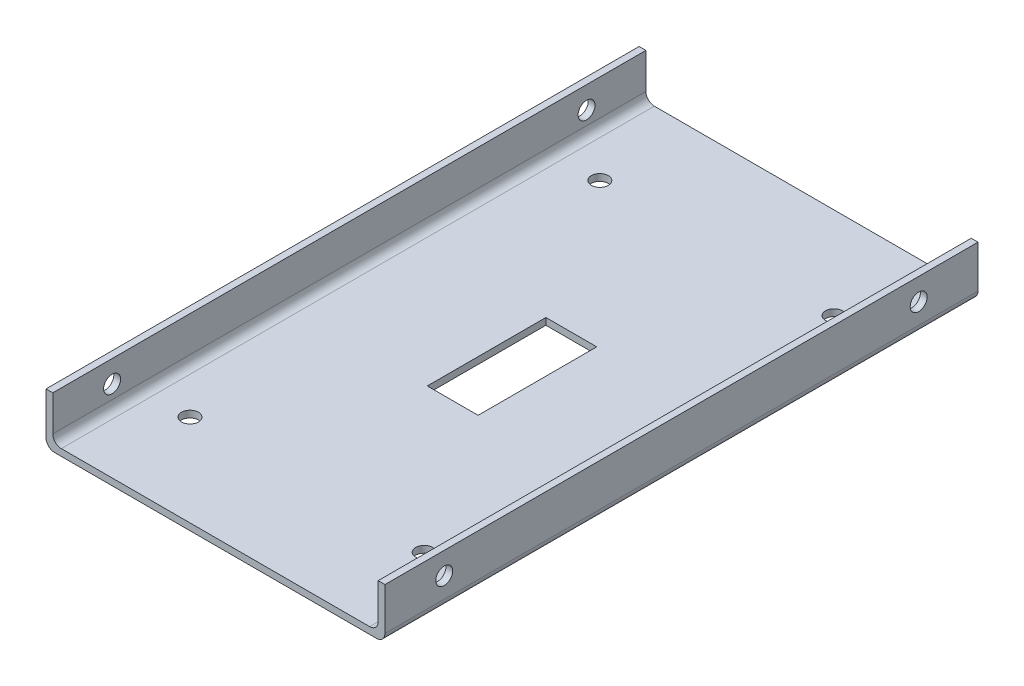
ISO-10303-21;
HEADER;
FILE_DESCRIPTION(('STEP AP214'),'2;1');
FILE_NAME('part.step','',(''),(''),'','','');
FILE_SCHEMA(('AUTOMOTIVE_DESIGN { 1 0 10303 214 1 1 1 1 }'));
ENDSEC;
DATA;
#1=APPLICATION_CONTEXT('core data for automotive mechanical design processes');
#2=APPLICATION_PROTOCOL_DEFINITION('international standard','automotive_design',2000,#1);
#3=PRODUCT_CONTEXT('',#1,'mechanical');
#4=PRODUCT('Part','Part','',(#3));
#5=PRODUCT_RELATED_PRODUCT_CATEGORY('part','',(#4));
#6=PRODUCT_DEFINITION_FORMATION('','',#4);
#7=PRODUCT_DEFINITION_CONTEXT('part definition',#1,'design');
#8=PRODUCT_DEFINITION('design','',#6,#7);
#9=PRODUCT_DEFINITION_SHAPE('','',#8);
#10=(LENGTH_UNIT() NAMED_UNIT(*) SI_UNIT(.MILLI.,.METRE.));
#11=(NAMED_UNIT(*) PLANE_ANGLE_UNIT() SI_UNIT($,.RADIAN.));
#12=(NAMED_UNIT(*) SI_UNIT($,.STERADIAN.) SOLID_ANGLE_UNIT());
#13=UNCERTAINTY_MEASURE_WITH_UNIT(LENGTH_MEASURE(1.E-05),#10,'distance_accuracy_value','');
#14=(GEOMETRIC_REPRESENTATION_CONTEXT(3) GLOBAL_UNCERTAINTY_ASSIGNED_CONTEXT((#13)) GLOBAL_UNIT_ASSIGNED_CONTEXT((#10,
#11,#12)) REPRESENTATION_CONTEXT('',''));
#15=CARTESIAN_POINT('',(0.,0.,0.));
#16=DIRECTION('',(0.,0.,1.));
#17=DIRECTION('',(1.,0.,0.));
#18=AXIS2_PLACEMENT_3D('',#15,#16,#17);
#19=CARTESIAN_POINT('',(0.,0.,350.));
#20=DIRECTION('',(0.,1.,0.));
#21=DIRECTION('',(0.,0.,1.));
#22=AXIS2_PLACEMENT_3D('',#19,#20,#21);
#23=PLANE('',#22);
#24=DIRECTION('',(1.,0.,0.));
#25=VECTOR('',#24,1.);
#26=CARTESIAN_POINT('',(0.,0.,350.));
#27=LINE('',#26,#25);
#28=CARTESIAN_POINT('',(5.,0.,350.));
#29=VERTEX_POINT('',#28);
#30=CARTESIAN_POINT('',(195.,0.,350.));
#31=VERTEX_POINT('',#30);
#32=EDGE_CURVE('E210',#29,#31,#27,.T.);
#33=ORIENTED_EDGE('',*,*,#32,.F.);
#34=DIRECTION('',(0.,0.,-1.));
#35=VECTOR('',#34,1.);
#36=CARTESIAN_POINT('',(5.,0.,350.));
#37=LINE('',#36,#35);
#38=CARTESIAN_POINT('',(5.,0.,0.));
#39=VERTEX_POINT('',#38);
#40=EDGE_CURVE('E260',#29,#39,#37,.T.);
#41=ORIENTED_EDGE('',*,*,#40,.T.);
#42=DIRECTION('',(1.,0.,0.));
#43=VECTOR('',#42,1.);
#44=CARTESIAN_POINT('',(0.,0.,0.));
#45=LINE('',#44,#43);
#46=CARTESIAN_POINT('',(195.,0.,0.));
#47=VERTEX_POINT('',#46);
#48=EDGE_CURVE('E231',#39,#47,#45,.T.);
#49=ORIENTED_EDGE('',*,*,#48,.T.);
#50=DIRECTION('',(0.,0.,-1.));
#51=VECTOR('',#50,1.);
#52=CARTESIAN_POINT('',(195.,0.,350.));
#53=LINE('',#52,#51);
#54=EDGE_CURVE('E258',#47,#31,#53,.F.);
#55=ORIENTED_EDGE('',*,*,#54,.T.);
#56=EDGE_LOOP('',(#33,#41,#49,#55));
#57=FACE_BOUND('',#56,.T.);
#58=CARTESIAN_POINT('',(30.8949335860125,0.,54.0661337755218));
#59=DIRECTION('',(0.,1.,0.));
#60=DIRECTION('',(0.,0.,1.));
#61=AXIS2_PLACEMENT_3D('',#58,#59,#60);
#62=CIRCLE('',#61,5.);
#63=CARTESIAN_POINT('',(30.8949335860125,0.,59.0661337755218));
#64=VERTEX_POINT('',#63);
#65=EDGE_CURVE('E182',#64,#64,#62,.T.);
#66=ORIENTED_EDGE('',*,*,#65,.T.);
#67=EDGE_LOOP('',(#66));
#68=FACE_BOUND('',#67,.T.);
#69=CARTESIAN_POINT('',(169.105066413988,0.,54.0661337755218));
#70=DIRECTION('',(0.,1.,0.));
#71=DIRECTION('',(0.,0.,1.));
#72=AXIS2_PLACEMENT_3D('',#69,#70,#71);
#73=CIRCLE('',#72,4.99999999999999);
#74=CARTESIAN_POINT('',(169.105066413988,0.,59.0661337755218));
#75=VERTEX_POINT('',#74);
#76=EDGE_CURVE('E178',#75,#75,#73,.T.);
#77=ORIENTED_EDGE('',*,*,#76,.T.);
#78=EDGE_LOOP('',(#77));
#79=FACE_BOUND('',#78,.T.);
#80=CARTESIAN_POINT('',(169.105066413988,0.,295.933866224478));
#81=DIRECTION('',(0.,1.,0.));
#82=DIRECTION('',(0.,0.,1.));
#83=AXIS2_PLACEMENT_3D('',#80,#81,#82);
#84=CIRCLE('',#83,4.99999999999999);
#85=CARTESIAN_POINT('',(169.105066413988,0.,300.933866224478));
#86=VERTEX_POINT('',#85);
#87=EDGE_CURVE('E174',#86,#86,#84,.T.);
#88=ORIENTED_EDGE('',*,*,#87,.T.);
#89=EDGE_LOOP('',(#88));
#90=FACE_BOUND('',#89,.T.);
#91=CARTESIAN_POINT('',(30.8949335860124,0.,295.933866224478));
#92=DIRECTION('',(0.,1.,0.));
#93=DIRECTION('',(0.,0.,1.));
#94=AXIS2_PLACEMENT_3D('',#91,#92,#93);
#95=CIRCLE('',#94,5.);
#96=CARTESIAN_POINT('',(30.8949335860124,0.,300.933866224478));
#97=VERTEX_POINT('',#96);
#98=EDGE_CURVE('E149',#97,#97,#95,.T.);
#99=ORIENTED_EDGE('',*,*,#98,.T.);
#100=EDGE_LOOP('',(#99));
#101=FACE_BOUND('',#100,.T.);
#102=DIRECTION('',(0.,0.,1.));
#103=VECTOR('',#102,1.);
#104=CARTESIAN_POINT('',(85.0000000000001,0.,140.));
#105=LINE('',#104,#103);
#106=CARTESIAN_POINT('',(85.0000000000001,0.,140.));
#107=VERTEX_POINT('',#106);
#108=CARTESIAN_POINT('',(85.0000000000001,0.,210.));
#109=VERTEX_POINT('',#108);
#110=EDGE_CURVE('E47',#107,#109,#105,.T.);
#111=ORIENTED_EDGE('',*,*,#110,.T.);
#112=DIRECTION('',(1.,0.,0.));
#113=VECTOR('',#112,1.);
#114=CARTESIAN_POINT('',(115.,0.,210.));
#115=LINE('',#114,#113);
#116=CARTESIAN_POINT('',(115.,0.,210.));
#117=VERTEX_POINT('',#116);
#118=EDGE_CURVE('E153',#109,#117,#115,.T.);
#119=ORIENTED_EDGE('',*,*,#118,.T.);
#120=DIRECTION('',(0.,0.,-1.));
#121=VECTOR('',#120,1.);
#122=CARTESIAN_POINT('',(115.,0.,140.));
#123=LINE('',#122,#121);
#124=CARTESIAN_POINT('',(115.,0.,140.));
#125=VERTEX_POINT('',#124);
#126=EDGE_CURVE('E159',#117,#125,#123,.T.);
#127=ORIENTED_EDGE('',*,*,#126,.T.);
#128=DIRECTION('',(-1.,0.,0.));
#129=VECTOR('',#128,1.);
#130=CARTESIAN_POINT('',(115.,0.,140.));
#131=LINE('',#130,#129);
#132=EDGE_CURVE('E162',#125,#107,#131,.T.);
#133=ORIENTED_EDGE('',*,*,#132,.T.);
#134=EDGE_LOOP('',(#111,#119,#127,#133));
#135=FACE_BOUND('',#134,.T.);
#136=ADVANCED_FACE('F32',(#57,#68,#79,#90,#101,#135),#23,.F.);
#137=CARTESIAN_POINT('',(4.00000000000001,4.,350.));
#138=DIRECTION('',(0.,-1.,0.));
#139=DIRECTION('',(1.,0.,0.));
#140=AXIS2_PLACEMENT_3D('',#137,#138,#139);
#141=PLANE('',#140);
#142=DIRECTION('',(-1.,0.,0.));
#143=VECTOR('',#142,1.);
#144=CARTESIAN_POINT('',(4.00000000000001,4.,350.));
#145=LINE('',#144,#143);
#146=CARTESIAN_POINT('',(191.,4.,350.));
#147=VERTEX_POINT('',#146);
#148=CARTESIAN_POINT('',(9.00000000000001,4.,350.));
#149=VERTEX_POINT('',#148);
#150=EDGE_CURVE('E221',#147,#149,#145,.T.);
#151=ORIENTED_EDGE('',*,*,#150,.F.);
#152=DIRECTION('',(0.,0.,-1.));
#153=VECTOR('',#152,1.);
#154=CARTESIAN_POINT('',(191.,4.,0.));
#155=LINE('',#154,#153);
#156=CARTESIAN_POINT('',(191.,4.,0.));
#157=VERTEX_POINT('',#156);
#158=EDGE_CURVE('E278',#147,#157,#155,.T.);
#159=ORIENTED_EDGE('',*,*,#158,.T.);
#160=DIRECTION('',(-1.,0.,0.));
#161=VECTOR('',#160,1.);
#162=CARTESIAN_POINT('',(4.00000000000001,4.,0.));
#163=LINE('',#162,#161);
#164=CARTESIAN_POINT('',(9.00000000000001,4.,0.));
#165=VERTEX_POINT('',#164);
#166=EDGE_CURVE('E241',#157,#165,#163,.T.);
#167=ORIENTED_EDGE('',*,*,#166,.T.);
#168=DIRECTION('',(0.,0.,-1.));
#169=VECTOR('',#168,1.);
#170=CARTESIAN_POINT('',(9.00000000000001,4.,350.));
#171=LINE('',#170,#169);
#172=EDGE_CURVE('E276',#165,#149,#171,.F.);
#173=ORIENTED_EDGE('',*,*,#172,.T.);
#174=EDGE_LOOP('',(#151,#159,#167,#173));
#175=FACE_BOUND('',#174,.T.);
#176=CARTESIAN_POINT('',(30.8949335860125,4.,54.0661337755218));
#177=DIRECTION('',(0.,-1.,0.));
#178=DIRECTION('',(1.,0.,0.));
#179=AXIS2_PLACEMENT_3D('',#176,#177,#178);
#180=CIRCLE('',#179,5.);
#181=CARTESIAN_POINT('',(35.8949335860124,4.,54.0661337755218));
#182=VERTEX_POINT('',#181);
#183=EDGE_CURVE('E185',#182,#182,#180,.F.);
#184=ORIENTED_EDGE('',*,*,#183,.F.);
#185=EDGE_LOOP('',(#184));
#186=FACE_BOUND('',#185,.T.);
#187=CARTESIAN_POINT('',(169.105066413988,4.,54.0661337755218));
#188=DIRECTION('',(0.,-1.,0.));
#189=DIRECTION('',(1.,0.,0.));
#190=AXIS2_PLACEMENT_3D('',#187,#188,#189);
#191=CIRCLE('',#190,4.99999999999999);
#192=CARTESIAN_POINT('',(174.105066413988,4.,54.0661337755218));
#193=VERTEX_POINT('',#192);
#194=EDGE_CURVE('E181',#193,#193,#191,.F.);
#195=ORIENTED_EDGE('',*,*,#194,.F.);
#196=EDGE_LOOP('',(#195));
#197=FACE_BOUND('',#196,.T.);
#198=CARTESIAN_POINT('',(169.105066413988,4.,295.933866224478));
#199=DIRECTION('',(0.,-1.,0.));
#200=DIRECTION('',(1.,0.,0.));
#201=AXIS2_PLACEMENT_3D('',#198,#199,#200);
#202=CIRCLE('',#201,4.99999999999999);
#203=CARTESIAN_POINT('',(174.105066413988,4.,295.933866224478));
#204=VERTEX_POINT('',#203);
#205=EDGE_CURVE('E177',#204,#204,#202,.F.);
#206=ORIENTED_EDGE('',*,*,#205,.F.);
#207=EDGE_LOOP('',(#206));
#208=FACE_BOUND('',#207,.T.);
#209=CARTESIAN_POINT('',(30.8949335860124,4.,295.933866224478));
#210=DIRECTION('',(0.,-1.,0.));
#211=DIRECTION('',(1.,0.,0.));
#212=AXIS2_PLACEMENT_3D('',#209,#210,#211);
#213=CIRCLE('',#212,5.);
#214=CARTESIAN_POINT('',(35.8949335860124,4.,295.933866224478));
#215=VERTEX_POINT('',#214);
#216=EDGE_CURVE('E173',#215,#215,#213,.F.);
#217=ORIENTED_EDGE('',*,*,#216,.F.);
#218=EDGE_LOOP('',(#217));
#219=FACE_BOUND('',#218,.T.);
#220=DIRECTION('',(0.,0.,1.));
#221=VECTOR('',#220,1.);
#222=CARTESIAN_POINT('',(85.0000000000001,4.,350.));
#223=LINE('',#222,#221);
#224=CARTESIAN_POINT('',(85.0000000000001,4.,140.));
#225=VERTEX_POINT('',#224);
#226=CARTESIAN_POINT('',(85.0000000000001,4.,210.));
#227=VERTEX_POINT('',#226);
#228=EDGE_CURVE('E11',#225,#227,#223,.T.);
#229=ORIENTED_EDGE('',*,*,#228,.F.);
#230=DIRECTION('',(-1.,0.,0.));
#231=VECTOR('',#230,1.);
#232=CARTESIAN_POINT('',(3.99999999999982,4.,140.));
#233=LINE('',#232,#231);
#234=CARTESIAN_POINT('',(115.,4.,140.));
#235=VERTEX_POINT('',#234);
#236=EDGE_CURVE('E294',#235,#225,#233,.T.);
#237=ORIENTED_EDGE('',*,*,#236,.F.);
#238=DIRECTION('',(0.,0.,-1.));
#239=VECTOR('',#238,1.);
#240=CARTESIAN_POINT('',(115.,4.,350.));
#241=LINE('',#240,#239);
#242=CARTESIAN_POINT('',(115.,4.,210.));
#243=VERTEX_POINT('',#242);
#244=EDGE_CURVE('E308',#243,#235,#241,.T.);
#245=ORIENTED_EDGE('',*,*,#244,.F.);
#246=DIRECTION('',(1.,0.,0.));
#247=VECTOR('',#246,1.);
#248=CARTESIAN_POINT('',(3.99999999999988,4.,210.));
#249=LINE('',#248,#247);
#250=EDGE_CURVE('E40',#227,#243,#249,.T.);
#251=ORIENTED_EDGE('',*,*,#250,.F.);
#252=EDGE_LOOP('',(#229,#237,#245,#251));
#253=FACE_BOUND('',#252,.T.);
#254=ADVANCED_FACE('F314',(#175,#186,#197,#208,#219,#253),#141,.F.);
#255=CARTESIAN_POINT('',(0.,30.,350.));
#256=DIRECTION('',(1.,0.,0.));
#257=DIRECTION('',(0.,1.,0.));
#258=AXIS2_PLACEMENT_3D('',#255,#256,#257);
#259=PLANE('',#258);
#260=CARTESIAN_POINT('',(0.,17.0000000000004,34.9999999999999));
#261=DIRECTION('',(1.,0.,0.));
#262=DIRECTION('',(0.,1.,0.));
#263=AXIS2_PLACEMENT_3D('',#260,#261,#262);
#264=CIRCLE('',#263,5.);
#265=CARTESIAN_POINT('',(0.,22.0000000000004,34.9999999999999));
#266=VERTEX_POINT('',#265);
#267=EDGE_CURVE('E193',#266,#266,#264,.T.);
#268=ORIENTED_EDGE('',*,*,#267,.T.);
#269=EDGE_LOOP('',(#268));
#270=FACE_BOUND('',#269,.T.);
#271=CARTESIAN_POINT('',(0.,17.0000000000004,315.));
#272=DIRECTION('',(1.,0.,0.));
#273=DIRECTION('',(0.,1.,0.));
#274=AXIS2_PLACEMENT_3D('',#271,#272,#273);
#275=CIRCLE('',#274,4.99999999999999);
#276=CARTESIAN_POINT('',(0.,22.0000000000004,315.));
#277=VERTEX_POINT('',#276);
#278=EDGE_CURVE('E203',#277,#277,#275,.T.);
#279=ORIENTED_EDGE('',*,*,#278,.T.);
#280=EDGE_LOOP('',(#279));
#281=FACE_BOUND('',#280,.T.);
#282=DIRECTION('',(0.,-1.,0.));
#283=VECTOR('',#282,1.);
#284=CARTESIAN_POINT('',(0.,30.,0.));
#285=LINE('',#284,#283);
#286=CARTESIAN_POINT('',(0.,30.,0.));
#287=VERTEX_POINT('',#286);
#288=CARTESIAN_POINT('',(0.,5.,0.));
#289=VERTEX_POINT('',#288);
#290=EDGE_CURVE('E206',#287,#289,#285,.T.);
#291=ORIENTED_EDGE('',*,*,#290,.T.);
#292=DIRECTION('',(0.,0.,-1.));
#293=VECTOR('',#292,1.);
#294=CARTESIAN_POINT('',(0.,5.,350.));
#295=LINE('',#294,#293);
#296=CARTESIAN_POINT('',(0.,5.,350.));
#297=VERTEX_POINT('',#296);
#298=EDGE_CURVE('E267',#289,#297,#295,.F.);
#299=ORIENTED_EDGE('',*,*,#298,.T.);
#300=DIRECTION('',(0.,-1.,0.));
#301=VECTOR('',#300,1.);
#302=CARTESIAN_POINT('',(0.,30.,350.));
#303=LINE('',#302,#301);
#304=CARTESIAN_POINT('',(0.,30.,350.));
#305=VERTEX_POINT('',#304);
#306=EDGE_CURVE('E207',#305,#297,#303,.T.);
#307=ORIENTED_EDGE('',*,*,#306,.F.);
#308=DIRECTION('',(0.,0.,-1.));
#309=VECTOR('',#308,1.);
#310=CARTESIAN_POINT('',(0.,30.,350.));
#311=LINE('',#310,#309);
#312=EDGE_CURVE('E228',#305,#287,#311,.T.);
#313=ORIENTED_EDGE('',*,*,#312,.T.);
#314=EDGE_LOOP('',(#291,#299,#307,#313));
#315=FACE_BOUND('',#314,.T.);
#316=ADVANCED_FACE('F328',(#270,#281,#315),#259,.F.);
#317=CARTESIAN_POINT('',(200.,30.,350.));
#318=DIRECTION('',(-1.,0.,0.));
#319=DIRECTION('',(0.,-1.,0.));
#320=AXIS2_PLACEMENT_3D('',#317,#318,#319);
#321=PLANE('',#320);
#322=CARTESIAN_POINT('',(200.,17.0000000000001,34.9999999999999));
#323=DIRECTION('',(1.,0.,0.));
#324=DIRECTION('',(0.,1.,0.));
#325=AXIS2_PLACEMENT_3D('',#322,#323,#324);
#326=CIRCLE('',#325,5.);
#327=CARTESIAN_POINT('',(200.,22.0000000000001,34.9999999999999));
#328=VERTEX_POINT('',#327);
#329=EDGE_CURVE('E186',#328,#328,#326,.T.);
#330=ORIENTED_EDGE('',*,*,#329,.F.);
#331=EDGE_LOOP('',(#330));
#332=FACE_BOUND('',#331,.T.);
#333=CARTESIAN_POINT('',(200.,17.0000000000001,315.));
#334=DIRECTION('',(1.,0.,0.));
#335=DIRECTION('',(0.,1.,0.));
#336=AXIS2_PLACEMENT_3D('',#333,#334,#335);
#337=CIRCLE('',#336,4.99999999999999);
#338=CARTESIAN_POINT('',(200.,22.0000000000001,315.));
#339=VERTEX_POINT('',#338);
#340=EDGE_CURVE('E196',#339,#339,#337,.T.);
#341=ORIENTED_EDGE('',*,*,#340,.F.);
#342=EDGE_LOOP('',(#341));
#343=FACE_BOUND('',#342,.T.);
#344=DIRECTION('',(0.,1.,0.));
#345=VECTOR('',#344,1.);
#346=CARTESIAN_POINT('',(200.,30.,350.));
#347=LINE('',#346,#345);
#348=CARTESIAN_POINT('',(200.,5.,350.));
#349=VERTEX_POINT('',#348);
#350=CARTESIAN_POINT('',(200.,30.,350.));
#351=VERTEX_POINT('',#350);
#352=EDGE_CURVE('E214',#349,#351,#347,.T.);
#353=ORIENTED_EDGE('',*,*,#352,.F.);
#354=DIRECTION('',(0.,0.,-1.));
#355=VECTOR('',#354,1.);
#356=CARTESIAN_POINT('',(200.,5.,350.));
#357=LINE('',#356,#355);
#358=CARTESIAN_POINT('',(200.,5.,0.));
#359=VERTEX_POINT('',#358);
#360=EDGE_CURVE('E273',#349,#359,#357,.T.);
#361=ORIENTED_EDGE('',*,*,#360,.T.);
#362=DIRECTION('',(0.,1.,0.));
#363=VECTOR('',#362,1.);
#364=CARTESIAN_POINT('',(200.,30.,0.));
#365=LINE('',#364,#363);
#366=CARTESIAN_POINT('',(200.,30.,0.));
#367=VERTEX_POINT('',#366);
#368=EDGE_CURVE('E234',#359,#367,#365,.T.);
#369=ORIENTED_EDGE('',*,*,#368,.T.);
#370=DIRECTION('',(0.,0.,-1.));
#371=VECTOR('',#370,1.);
#372=CARTESIAN_POINT('',(200.,30.,350.));
#373=LINE('',#372,#371);
#374=EDGE_CURVE('E255',#351,#367,#373,.T.);
#375=ORIENTED_EDGE('',*,*,#374,.F.);
#376=EDGE_LOOP('',(#353,#361,#369,#375));
#377=FACE_BOUND('',#376,.T.);
#378=ADVANCED_FACE('F335',(#332,#343,#377),#321,.F.);
#379=CARTESIAN_POINT('',(196.,30.,350.));
#380=DIRECTION('',(0.,-1.,0.));
#381=DIRECTION('',(0.,0.,-1.));
#382=AXIS2_PLACEMENT_3D('',#379,#380,#381);
#383=PLANE('',#382);
#384=DIRECTION('',(-1.,0.,0.));
#385=VECTOR('',#384,1.);
#386=CARTESIAN_POINT('',(196.,30.,0.));
#387=LINE('',#386,#385);
#388=CARTESIAN_POINT('',(196.,30.,0.));
#389=VERTEX_POINT('',#388);
#390=EDGE_CURVE('E236',#367,#389,#387,.T.);
#391=ORIENTED_EDGE('',*,*,#390,.T.);
#392=DIRECTION('',(0.,0.,-1.));
#393=VECTOR('',#392,1.);
#394=CARTESIAN_POINT('',(196.,30.,350.));
#395=LINE('',#394,#393);
#396=CARTESIAN_POINT('',(196.,30.,350.));
#397=VERTEX_POINT('',#396);
#398=EDGE_CURVE('E252',#397,#389,#395,.T.);
#399=ORIENTED_EDGE('',*,*,#398,.F.);
#400=DIRECTION('',(-1.,0.,0.));
#401=VECTOR('',#400,1.);
#402=CARTESIAN_POINT('',(196.,30.,350.));
#403=LINE('',#402,#401);
#404=EDGE_CURVE('E216',#351,#397,#403,.T.);
#405=ORIENTED_EDGE('',*,*,#404,.F.);
#406=ORIENTED_EDGE('',*,*,#374,.T.);
#407=EDGE_LOOP('',(#391,#399,#405,#406));
#408=FACE_BOUND('',#407,.T.);
#409=ADVANCED_FACE('F397',(#408),#383,.F.);
#410=CARTESIAN_POINT('',(196.,4.,350.));
#411=DIRECTION('',(1.,0.,0.));
#412=DIRECTION('',(0.,0.,-1.));
#413=AXIS2_PLACEMENT_3D('',#410,#411,#412);
#414=PLANE('',#413);
#415=CARTESIAN_POINT('',(196.,17.0000000000001,34.9999999999999));
#416=DIRECTION('',(1.,0.,0.));
#417=DIRECTION('',(0.,0.,-1.));
#418=AXIS2_PLACEMENT_3D('',#415,#416,#417);
#419=CIRCLE('',#418,5.);
#420=CARTESIAN_POINT('',(196.,17.0000000000001,29.9999999999999));
#421=VERTEX_POINT('',#420);
#422=EDGE_CURVE('E190',#421,#421,#419,.T.);
#423=ORIENTED_EDGE('',*,*,#422,.T.);
#424=EDGE_LOOP('',(#423));
#425=FACE_BOUND('',#424,.T.);
#426=CARTESIAN_POINT('',(196.,17.0000000000001,315.));
#427=DIRECTION('',(1.,0.,0.));
#428=DIRECTION('',(0.,0.,-1.));
#429=AXIS2_PLACEMENT_3D('',#426,#427,#428);
#430=CIRCLE('',#429,4.99999999999999);
#431=CARTESIAN_POINT('',(196.,17.0000000000001,310.));
#432=VERTEX_POINT('',#431);
#433=EDGE_CURVE('E200',#432,#432,#430,.T.);
#434=ORIENTED_EDGE('',*,*,#433,.T.);
#435=EDGE_LOOP('',(#434));
#436=FACE_BOUND('',#435,.T.);
#437=DIRECTION('',(0.,-1.,0.));
#438=VECTOR('',#437,1.);
#439=CARTESIAN_POINT('',(196.,4.,0.));
#440=LINE('',#439,#438);
#441=CARTESIAN_POINT('',(196.,9.,0.));
#442=VERTEX_POINT('',#441);
#443=EDGE_CURVE('E238',#389,#442,#440,.T.);
#444=ORIENTED_EDGE('',*,*,#443,.T.);
#445=DIRECTION('',(0.,0.,-1.));
#446=VECTOR('',#445,1.);
#447=CARTESIAN_POINT('',(196.,9.,350.));
#448=LINE('',#447,#446);
#449=CARTESIAN_POINT('',(196.,9.,350.));
#450=VERTEX_POINT('',#449);
#451=EDGE_CURVE('E281',#442,#450,#448,.F.);
#452=ORIENTED_EDGE('',*,*,#451,.T.);
#453=DIRECTION('',(0.,-1.,0.));
#454=VECTOR('',#453,1.);
#455=CARTESIAN_POINT('',(196.,4.,350.));
#456=LINE('',#455,#454);
#457=EDGE_CURVE('E218',#397,#450,#456,.T.);
#458=ORIENTED_EDGE('',*,*,#457,.F.);
#459=ORIENTED_EDGE('',*,*,#398,.T.);
#460=EDGE_LOOP('',(#444,#452,#458,#459));
#461=FACE_BOUND('',#460,.T.);
#462=ADVANCED_FACE('F400',(#425,#436,#461),#414,.F.);
#463=CARTESIAN_POINT('',(4.,30.,350.));
#464=DIRECTION('',(-1.,0.,0.));
#465=DIRECTION('',(0.,-1.,0.));
#466=AXIS2_PLACEMENT_3D('',#463,#464,#465);
#467=PLANE('',#466);
#468=CARTESIAN_POINT('',(4.,17.0000000000004,34.9999999999999));
#469=DIRECTION('',(-1.,0.,0.));
#470=DIRECTION('',(0.,-1.,0.));
#471=AXIS2_PLACEMENT_3D('',#468,#469,#470);
#472=CIRCLE('',#471,5.);
#473=CARTESIAN_POINT('',(4.00000000000001,12.0000000000004,34.9999999999999));
#474=VERTEX_POINT('',#473);
#475=EDGE_CURVE('E189',#474,#474,#472,.T.);
#476=ORIENTED_EDGE('',*,*,#475,.T.);
#477=EDGE_LOOP('',(#476));
#478=FACE_BOUND('',#477,.T.);
#479=CARTESIAN_POINT('',(4.,17.0000000000004,315.));
#480=DIRECTION('',(-1.,0.,0.));
#481=DIRECTION('',(0.,-1.,0.));
#482=AXIS2_PLACEMENT_3D('',#479,#480,#481);
#483=CIRCLE('',#482,4.99999999999999);
#484=CARTESIAN_POINT('',(4.00000000000001,12.0000000000004,315.));
#485=VERTEX_POINT('',#484);
#486=EDGE_CURVE('E199',#485,#485,#483,.T.);
#487=ORIENTED_EDGE('',*,*,#486,.T.);
#488=EDGE_LOOP('',(#487));
#489=FACE_BOUND('',#488,.T.);
#490=DIRECTION('',(0.,1.,0.));
#491=VECTOR('',#490,1.);
#492=CARTESIAN_POINT('',(4.,30.,350.));
#493=LINE('',#492,#491);
#494=CARTESIAN_POINT('',(4.00000000000001,9.00000000000001,350.));
#495=VERTEX_POINT('',#494);
#496=CARTESIAN_POINT('',(4.,30.,350.));
#497=VERTEX_POINT('',#496);
#498=EDGE_CURVE('E224',#495,#497,#493,.T.);
#499=ORIENTED_EDGE('',*,*,#498,.F.);
#500=DIRECTION('',(0.,0.,-1.));
#501=VECTOR('',#500,1.);
#502=CARTESIAN_POINT('',(4.00000000000001,9.,0.));
#503=LINE('',#502,#501);
#504=CARTESIAN_POINT('',(4.00000000000001,9.00000000000001,0.));
#505=VERTEX_POINT('',#504);
#506=EDGE_CURVE('E283',#495,#505,#503,.T.);
#507=ORIENTED_EDGE('',*,*,#506,.T.);
#508=DIRECTION('',(0.,1.,0.));
#509=VECTOR('',#508,1.);
#510=CARTESIAN_POINT('',(4.,30.,0.));
#511=LINE('',#510,#509);
#512=CARTESIAN_POINT('',(4.,30.,0.));
#513=VERTEX_POINT('',#512);
#514=EDGE_CURVE('E244',#505,#513,#511,.T.);
#515=ORIENTED_EDGE('',*,*,#514,.T.);
#516=DIRECTION('',(0.,0.,-1.));
#517=VECTOR('',#516,1.);
#518=CARTESIAN_POINT('',(4.,30.,350.));
#519=LINE('',#518,#517);
#520=EDGE_CURVE('E249',#497,#513,#519,.T.);
#521=ORIENTED_EDGE('',*,*,#520,.F.);
#522=EDGE_LOOP('',(#499,#507,#515,#521));
#523=FACE_BOUND('',#522,.T.);
#524=ADVANCED_FACE('F371',(#478,#489,#523),#467,.F.);
#525=CARTESIAN_POINT('',(0.,30.,350.));
#526=DIRECTION('',(0.,-1.,0.));
#527=DIRECTION('',(1.,0.,0.));
#528=AXIS2_PLACEMENT_3D('',#525,#526,#527);
#529=PLANE('',#528);
#530=DIRECTION('',(-1.,0.,0.));
#531=VECTOR('',#530,1.);
#532=CARTESIAN_POINT('',(0.,30.,0.));
#533=LINE('',#532,#531);
#534=EDGE_CURVE('E211',#513,#287,#533,.T.);
#535=ORIENTED_EDGE('',*,*,#534,.T.);
#536=ORIENTED_EDGE('',*,*,#312,.F.);
#537=DIRECTION('',(-1.,0.,0.));
#538=VECTOR('',#537,1.);
#539=CARTESIAN_POINT('',(0.,30.,350.));
#540=LINE('',#539,#538);
#541=EDGE_CURVE('E226',#497,#305,#540,.T.);
#542=ORIENTED_EDGE('',*,*,#541,.F.);
#543=ORIENTED_EDGE('',*,*,#520,.T.);
#544=EDGE_LOOP('',(#535,#536,#542,#543));
#545=FACE_BOUND('',#544,.T.);
#546=ADVANCED_FACE('F377',(#545),#529,.F.);
#547=CARTESIAN_POINT('',(0.,0.,350.));
#548=DIRECTION('',(0.,0.,1.));
#549=DIRECTION('',(1.,0.,0.));
#550=AXIS2_PLACEMENT_3D('',#547,#548,#549);
#551=PLANE('',#550);
#552=ORIENTED_EDGE('',*,*,#306,.T.);
#553=CARTESIAN_POINT('',(5.,5.,350.));
#554=DIRECTION('',(0.,0.,1.));
#555=DIRECTION('',(1.,0.,0.));
#556=AXIS2_PLACEMENT_3D('',#553,#554,#555);
#557=CIRCLE('',#556,5.);
#558=EDGE_CURVE('E271',#297,#29,#557,.T.);
#559=ORIENTED_EDGE('',*,*,#558,.T.);
#560=ORIENTED_EDGE('',*,*,#32,.T.);
#561=CARTESIAN_POINT('',(195.,5.,350.));
#562=DIRECTION('',(0.,0.,1.));
#563=DIRECTION('',(1.,0.,0.));
#564=AXIS2_PLACEMENT_3D('',#561,#562,#563);
#565=CIRCLE('',#564,5.);
#566=EDGE_CURVE('E269',#31,#349,#565,.T.);
#567=ORIENTED_EDGE('',*,*,#566,.T.);
#568=ORIENTED_EDGE('',*,*,#352,.T.);
#569=ORIENTED_EDGE('',*,*,#404,.T.);
#570=ORIENTED_EDGE('',*,*,#457,.T.);
#571=CARTESIAN_POINT('',(191.,9.,350.));
#572=DIRECTION('',(0.,0.,1.));
#573=DIRECTION('',(1.,0.,0.));
#574=AXIS2_PLACEMENT_3D('',#571,#572,#573);
#575=CIRCLE('',#574,5.);
#576=EDGE_CURVE('E288',#450,#147,#575,.F.);
#577=ORIENTED_EDGE('',*,*,#576,.T.);
#578=ORIENTED_EDGE('',*,*,#150,.T.);
#579=CARTESIAN_POINT('',(9.00000000000001,9.00000000000001,350.));
#580=DIRECTION('',(0.,0.,1.));
#581=DIRECTION('',(1.,0.,0.));
#582=AXIS2_PLACEMENT_3D('',#579,#580,#581);
#583=CIRCLE('',#582,5.);
#584=EDGE_CURVE('E292',#149,#495,#583,.F.);
#585=ORIENTED_EDGE('',*,*,#584,.T.);
#586=ORIENTED_EDGE('',*,*,#498,.T.);
#587=ORIENTED_EDGE('',*,*,#541,.T.);
#588=EDGE_LOOP('',(#552,#559,#560,#567,#568,#569,#570,#577,#578,#585,#586,#587));
#589=FACE_BOUND('',#588,.T.);
#590=ADVANCED_FACE('F361',(#589),#551,.T.);
#591=CARTESIAN_POINT('',(0.,0.,0.));
#592=DIRECTION('',(0.,0.,1.));
#593=DIRECTION('',(1.,0.,0.));
#594=AXIS2_PLACEMENT_3D('',#591,#592,#593);
#595=PLANE('',#594);
#596=ORIENTED_EDGE('',*,*,#48,.F.);
#597=CARTESIAN_POINT('',(5.,5.,0.));
#598=DIRECTION('',(0.,0.,1.));
#599=DIRECTION('',(1.,0.,0.));
#600=AXIS2_PLACEMENT_3D('',#597,#598,#599);
#601=CIRCLE('',#600,5.);
#602=EDGE_CURVE('E265',#39,#289,#601,.F.);
#603=ORIENTED_EDGE('',*,*,#602,.T.);
#604=ORIENTED_EDGE('',*,*,#290,.F.);
#605=ORIENTED_EDGE('',*,*,#534,.F.);
#606=ORIENTED_EDGE('',*,*,#514,.F.);
#607=CARTESIAN_POINT('',(9.00000000000001,9.00000000000001,0.));
#608=DIRECTION('',(0.,0.,1.));
#609=DIRECTION('',(1.,0.,0.));
#610=AXIS2_PLACEMENT_3D('',#607,#608,#609);
#611=CIRCLE('',#610,5.);
#612=EDGE_CURVE('E290',#505,#165,#611,.T.);
#613=ORIENTED_EDGE('',*,*,#612,.T.);
#614=ORIENTED_EDGE('',*,*,#166,.F.);
#615=CARTESIAN_POINT('',(191.,9.,0.));
#616=DIRECTION('',(0.,0.,1.));
#617=DIRECTION('',(1.,0.,0.));
#618=AXIS2_PLACEMENT_3D('',#615,#616,#617);
#619=CIRCLE('',#618,5.);
#620=EDGE_CURVE('E286',#157,#442,#619,.T.);
#621=ORIENTED_EDGE('',*,*,#620,.T.);
#622=ORIENTED_EDGE('',*,*,#443,.F.);
#623=ORIENTED_EDGE('',*,*,#390,.F.);
#624=ORIENTED_EDGE('',*,*,#368,.F.);
#625=CARTESIAN_POINT('',(195.,5.,0.));
#626=DIRECTION('',(0.,0.,1.));
#627=DIRECTION('',(1.,0.,0.));
#628=AXIS2_PLACEMENT_3D('',#625,#626,#627);
#629=CIRCLE('',#628,5.);
#630=EDGE_CURVE('E263',#359,#47,#629,.F.);
#631=ORIENTED_EDGE('',*,*,#630,.T.);
#632=EDGE_LOOP('',(#596,#603,#604,#605,#606,#613,#614,#621,#622,#623,#624,#631));
#633=FACE_BOUND('',#632,.T.);
#634=ADVANCED_FACE('F344',(#633),#595,.F.);
#635=CARTESIAN_POINT('',(5.,5.,350.));
#636=DIRECTION('',(0.,0.,-1.));
#637=DIRECTION('',(-1.,0.,0.));
#638=AXIS2_PLACEMENT_3D('',#635,#636,#637);
#639=CYLINDRICAL_SURFACE('',#638,5.);
#640=ORIENTED_EDGE('',*,*,#558,.F.);
#641=ORIENTED_EDGE('',*,*,#298,.F.);
#642=ORIENTED_EDGE('',*,*,#602,.F.);
#643=ORIENTED_EDGE('',*,*,#40,.F.);
#644=EDGE_LOOP('',(#640,#641,#642,#643));
#645=FACE_BOUND('',#644,.T.);
#646=ADVANCED_FACE('F340',(#645),#639,.T.);
#647=CARTESIAN_POINT('',(195.,5.,350.));
#648=DIRECTION('',(0.,0.,-1.));
#649=DIRECTION('',(-1.,0.,0.));
#650=AXIS2_PLACEMENT_3D('',#647,#648,#649);
#651=CYLINDRICAL_SURFACE('',#650,5.);
#652=ORIENTED_EDGE('',*,*,#566,.F.);
#653=ORIENTED_EDGE('',*,*,#54,.F.);
#654=ORIENTED_EDGE('',*,*,#630,.F.);
#655=ORIENTED_EDGE('',*,*,#360,.F.);
#656=EDGE_LOOP('',(#652,#653,#654,#655));
#657=FACE_BOUND('',#656,.T.);
#658=ADVANCED_FACE('F343',(#657),#651,.T.);
#659=CARTESIAN_POINT('',(191.,9.,350.));
#660=DIRECTION('',(0.,0.,1.));
#661=DIRECTION('',(1.,0.,0.));
#662=AXIS2_PLACEMENT_3D('',#659,#660,#661);
#663=CYLINDRICAL_SURFACE('',#662,5.);
#664=ORIENTED_EDGE('',*,*,#576,.F.);
#665=ORIENTED_EDGE('',*,*,#451,.F.);
#666=ORIENTED_EDGE('',*,*,#620,.F.);
#667=ORIENTED_EDGE('',*,*,#158,.F.);
#668=EDGE_LOOP('',(#664,#665,#666,#667));
#669=FACE_BOUND('',#668,.T.);
#670=ADVANCED_FACE('F347',(#669),#663,.F.);
#671=CARTESIAN_POINT('',(9.00000000000001,9.00000000000001,350.));
#672=DIRECTION('',(0.,0.,1.));
#673=DIRECTION('',(1.,0.,0.));
#674=AXIS2_PLACEMENT_3D('',#671,#672,#673);
#675=CYLINDRICAL_SURFACE('',#674,5.);
#676=ORIENTED_EDGE('',*,*,#584,.F.);
#677=ORIENTED_EDGE('',*,*,#172,.F.);
#678=ORIENTED_EDGE('',*,*,#612,.F.);
#679=ORIENTED_EDGE('',*,*,#506,.F.);
#680=EDGE_LOOP('',(#676,#677,#678,#679));
#681=FACE_BOUND('',#680,.T.);
#682=ADVANCED_FACE('F34',(#681),#675,.F.);
#683=CARTESIAN_POINT('',(-99.9999999999999,17.0000000000005,315.));
#684=DIRECTION('',(1.,0.,0.));
#685=DIRECTION('',(0.,1.,0.));
#686=AXIS2_PLACEMENT_3D('',#683,#684,#685);
#687=CYLINDRICAL_SURFACE('',#686,4.99999999999999);
#688=ORIENTED_EDGE('',*,*,#486,.F.);
#689=EDGE_LOOP('',(#688));
#690=FACE_BOUND('',#689,.T.);
#691=ORIENTED_EDGE('',*,*,#278,.F.);
#692=EDGE_LOOP('',(#691));
#693=FACE_BOUND('',#692,.T.);
#694=ADVANCED_FACE('F354',(#690,#693),#687,.F.);
#695=ORIENTED_EDGE('',*,*,#340,.T.);
#696=EDGE_LOOP('',(#695));
#697=FACE_BOUND('',#696,.T.);
#698=ORIENTED_EDGE('',*,*,#433,.F.);
#699=EDGE_LOOP('',(#698));
#700=FACE_BOUND('',#699,.T.);
#701=ADVANCED_FACE('F420',(#697,#700),#687,.F.);
#702=CARTESIAN_POINT('',(-99.9999999999999,17.0000000000005,34.9999999999999));
#703=DIRECTION('',(1.,0.,0.));
#704=DIRECTION('',(0.,1.,0.));
#705=AXIS2_PLACEMENT_3D('',#702,#703,#704);
#706=CYLINDRICAL_SURFACE('',#705,5.);
#707=ORIENTED_EDGE('',*,*,#475,.F.);
#708=EDGE_LOOP('',(#707));
#709=FACE_BOUND('',#708,.T.);
#710=ORIENTED_EDGE('',*,*,#267,.F.);
#711=EDGE_LOOP('',(#710));
#712=FACE_BOUND('',#711,.T.);
#713=ADVANCED_FACE('F422',(#709,#712),#706,.F.);
#714=ORIENTED_EDGE('',*,*,#329,.T.);
#715=EDGE_LOOP('',(#714));
#716=FACE_BOUND('',#715,.T.);
#717=ORIENTED_EDGE('',*,*,#422,.F.);
#718=EDGE_LOOP('',(#717));
#719=FACE_BOUND('',#718,.T.);
#720=ADVANCED_FACE('F425',(#716,#719),#706,.F.);
#721=CARTESIAN_POINT('',(30.8949335860125,10.,54.0661337755218));
#722=DIRECTION('',(0.,-1.,0.));
#723=DIRECTION('',(0.,0.,-1.));
#724=AXIS2_PLACEMENT_3D('',#721,#722,#723);
#725=CYLINDRICAL_SURFACE('',#724,5.);
#726=ORIENTED_EDGE('',*,*,#65,.F.);
#727=EDGE_LOOP('',(#726));
#728=FACE_BOUND('',#727,.T.);
#729=ORIENTED_EDGE('',*,*,#183,.T.);
#730=EDGE_LOOP('',(#729));
#731=FACE_BOUND('',#730,.T.);
#732=ADVANCED_FACE('F427',(#728,#731),#725,.F.);
#733=CARTESIAN_POINT('',(169.105066413988,10.,54.0661337755218));
#734=DIRECTION('',(0.,-1.,0.));
#735=DIRECTION('',(0.,0.,-1.));
#736=AXIS2_PLACEMENT_3D('',#733,#734,#735);
#737=CYLINDRICAL_SURFACE('',#736,4.99999999999999);
#738=ORIENTED_EDGE('',*,*,#76,.F.);
#739=EDGE_LOOP('',(#738));
#740=FACE_BOUND('',#739,.T.);
#741=ORIENTED_EDGE('',*,*,#194,.T.);
#742=EDGE_LOOP('',(#741));
#743=FACE_BOUND('',#742,.T.);
#744=ADVANCED_FACE('F430',(#740,#743),#737,.F.);
#745=CARTESIAN_POINT('',(169.105066413988,10.,295.933866224478));
#746=DIRECTION('',(0.,-1.,0.));
#747=DIRECTION('',(0.,0.,-1.));
#748=AXIS2_PLACEMENT_3D('',#745,#746,#747);
#749=CYLINDRICAL_SURFACE('',#748,4.99999999999999);
#750=ORIENTED_EDGE('',*,*,#87,.F.);
#751=EDGE_LOOP('',(#750));
#752=FACE_BOUND('',#751,.T.);
#753=ORIENTED_EDGE('',*,*,#205,.T.);
#754=EDGE_LOOP('',(#753));
#755=FACE_BOUND('',#754,.T.);
#756=ADVANCED_FACE('F434',(#752,#755),#749,.F.);
#757=CARTESIAN_POINT('',(30.8949335860124,10.,295.933866224478));
#758=DIRECTION('',(0.,-1.,0.));
#759=DIRECTION('',(0.,0.,-1.));
#760=AXIS2_PLACEMENT_3D('',#757,#758,#759);
#761=CYLINDRICAL_SURFACE('',#760,5.);
#762=ORIENTED_EDGE('',*,*,#98,.F.);
#763=EDGE_LOOP('',(#762));
#764=FACE_BOUND('',#763,.T.);
#765=ORIENTED_EDGE('',*,*,#216,.T.);
#766=EDGE_LOOP('',(#765));
#767=FACE_BOUND('',#766,.T.);
#768=ADVANCED_FACE('F438',(#764,#767),#761,.F.);
#769=CARTESIAN_POINT('',(85.0000000000001,10.,140.));
#770=DIRECTION('',(1.,0.,0.));
#771=DIRECTION('',(0.,0.,-1.));
#772=AXIS2_PLACEMENT_3D('',#769,#770,#771);
#773=PLANE('',#772);
#774=ORIENTED_EDGE('',*,*,#228,.T.);
#775=DIRECTION('',(0.,-1.,0.));
#776=VECTOR('',#775,1.);
#777=CARTESIAN_POINT('',(85.0000000000001,10.,210.));
#778=LINE('',#777,#776);
#779=EDGE_CURVE('E143',#227,#109,#778,.T.);
#780=ORIENTED_EDGE('',*,*,#779,.T.);
#781=ORIENTED_EDGE('',*,*,#110,.F.);
#782=DIRECTION('',(0.,-1.,0.));
#783=VECTOR('',#782,1.);
#784=CARTESIAN_POINT('',(85.0000000000001,10.,140.));
#785=LINE('',#784,#783);
#786=EDGE_CURVE('E167',#225,#107,#785,.T.);
#787=ORIENTED_EDGE('',*,*,#786,.F.);
#788=EDGE_LOOP('',(#774,#780,#781,#787));
#789=FACE_BOUND('',#788,.T.);
#790=ADVANCED_FACE('F145',(#789),#773,.T.);
#791=CARTESIAN_POINT('',(115.,10.,210.));
#792=DIRECTION('',(0.,0.,-1.));
#793=DIRECTION('',(-1.,0.,0.));
#794=AXIS2_PLACEMENT_3D('',#791,#792,#793);
#795=PLANE('',#794);
#796=ORIENTED_EDGE('',*,*,#250,.T.);
#797=DIRECTION('',(0.,-1.,0.));
#798=VECTOR('',#797,1.);
#799=CARTESIAN_POINT('',(115.,10.,210.));
#800=LINE('',#799,#798);
#801=EDGE_CURVE('E150',#243,#117,#800,.T.);
#802=ORIENTED_EDGE('',*,*,#801,.T.);
#803=ORIENTED_EDGE('',*,*,#118,.F.);
#804=ORIENTED_EDGE('',*,*,#779,.F.);
#805=EDGE_LOOP('',(#796,#802,#803,#804));
#806=FACE_BOUND('',#805,.T.);
#807=ADVANCED_FACE('F154',(#806),#795,.T.);
#808=CARTESIAN_POINT('',(115.,10.,140.));
#809=DIRECTION('',(-1.,0.,0.));
#810=DIRECTION('',(0.,0.,1.));
#811=AXIS2_PLACEMENT_3D('',#808,#809,#810);
#812=PLANE('',#811);
#813=ORIENTED_EDGE('',*,*,#244,.T.);
#814=DIRECTION('',(0.,-1.,0.));
#815=VECTOR('',#814,1.);
#816=CARTESIAN_POINT('',(115.,10.,140.));
#817=LINE('',#816,#815);
#818=EDGE_CURVE('E55',#235,#125,#817,.T.);
#819=ORIENTED_EDGE('',*,*,#818,.T.);
#820=ORIENTED_EDGE('',*,*,#126,.F.);
#821=ORIENTED_EDGE('',*,*,#801,.F.);
#822=EDGE_LOOP('',(#813,#819,#820,#821));
#823=FACE_BOUND('',#822,.T.);
#824=ADVANCED_FACE('F312',(#823),#812,.T.);
#825=CARTESIAN_POINT('',(115.,10.,140.));
#826=DIRECTION('',(0.,0.,1.));
#827=DIRECTION('',(1.,0.,0.));
#828=AXIS2_PLACEMENT_3D('',#825,#826,#827);
#829=PLANE('',#828);
#830=ORIENTED_EDGE('',*,*,#236,.T.);
#831=ORIENTED_EDGE('',*,*,#786,.T.);
#832=ORIENTED_EDGE('',*,*,#132,.F.);
#833=ORIENTED_EDGE('',*,*,#818,.F.);
#834=EDGE_LOOP('',(#830,#831,#832,#833));
#835=FACE_BOUND('',#834,.T.);
#836=ADVANCED_FACE('F315',(#835),#829,.T.);
#837=CLOSED_SHELL('',(#136,#254,#316,#378,#409,#462,#524,#546,#590,#634,#646,#658,#670,#682,
#694,#701,#713,#720,#732,#744,#756,#768,#790,#807,#824,#836));
#838=MANIFOLD_SOLID_BREP('B2',#837);
#839=ADVANCED_BREP_SHAPE_REPRESENTATION('',(#18,#838),#14);
#840=SHAPE_DEFINITION_REPRESENTATION(#9,#839);
ENDSEC;
END-ISO-10303-21;
